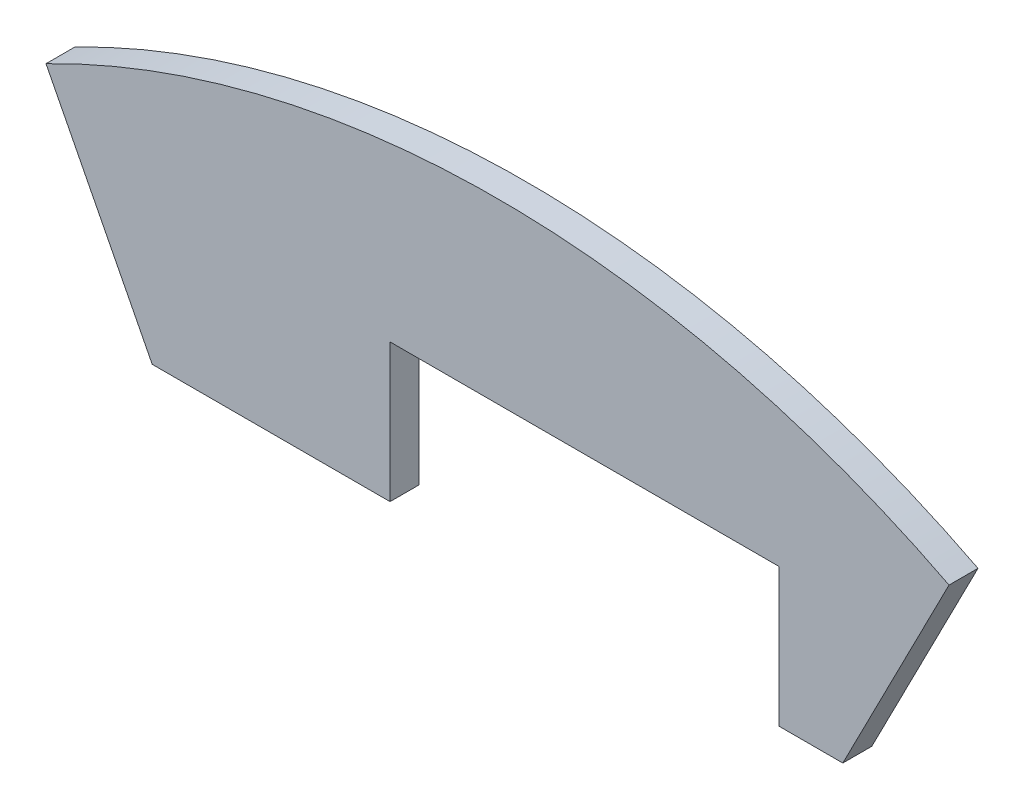
ISO-10303-21;
HEADER;
FILE_DESCRIPTION(('STEP AP214'),'2;1');
FILE_NAME('part.step','',(''),(''),'','','');
FILE_SCHEMA(('AUTOMOTIVE_DESIGN { 1 0 10303 214 1 1 1 1 }'));
ENDSEC;
DATA;
#1=APPLICATION_CONTEXT('core data for automotive mechanical design processes');
#2=APPLICATION_PROTOCOL_DEFINITION('international standard','automotive_design',2000,#1);
#3=PRODUCT_CONTEXT('',#1,'mechanical');
#4=PRODUCT('Part','Part','',(#3));
#5=PRODUCT_RELATED_PRODUCT_CATEGORY('part','',(#4));
#6=PRODUCT_DEFINITION_FORMATION('','',#4);
#7=PRODUCT_DEFINITION_CONTEXT('part definition',#1,'design');
#8=PRODUCT_DEFINITION('design','',#6,#7);
#9=PRODUCT_DEFINITION_SHAPE('','',#8);
#10=(LENGTH_UNIT() NAMED_UNIT(*) SI_UNIT(.MILLI.,.METRE.));
#11=(NAMED_UNIT(*) PLANE_ANGLE_UNIT() SI_UNIT($,.RADIAN.));
#12=(NAMED_UNIT(*) SI_UNIT($,.STERADIAN.) SOLID_ANGLE_UNIT());
#13=UNCERTAINTY_MEASURE_WITH_UNIT(LENGTH_MEASURE(1.E-05),#10,'distance_accuracy_value','');
#14=(GEOMETRIC_REPRESENTATION_CONTEXT(3) GLOBAL_UNCERTAINTY_ASSIGNED_CONTEXT((#13)) GLOBAL_UNIT_ASSIGNED_CONTEXT((#10,
#11,#12)) REPRESENTATION_CONTEXT('',''));
#15=CARTESIAN_POINT('',(0.,0.,0.));
#16=DIRECTION('',(0.,0.,1.));
#17=DIRECTION('',(1.,0.,0.));
#18=AXIS2_PLACEMENT_3D('',#15,#16,#17);
#19=CARTESIAN_POINT('',(-11.78,73.8595635754552,3.175));
#20=DIRECTION('',(-1.,0.,0.));
#21=DIRECTION('',(0.,0.,1.));
#22=AXIS2_PLACEMENT_3D('',#19,#20,#21);
#23=PLANE('',#22);
#24=DIRECTION('',(0.,1.,0.));
#25=VECTOR('',#24,1.);
#26=CARTESIAN_POINT('',(-11.78,73.8595635754552,0.));
#27=LINE('',#26,#25);
#28=CARTESIAN_POINT('',(-11.78,73.8595635754552,0.));
#29=VERTEX_POINT('',#28);
#30=CARTESIAN_POINT('',(-11.78,89.0244871513204,0.));
#31=VERTEX_POINT('',#30);
#32=EDGE_CURVE('E127',#29,#31,#27,.T.);
#33=ORIENTED_EDGE('',*,*,#32,.T.);
#34=DIRECTION('',(0.,0.,-1.));
#35=VECTOR('',#34,1.);
#36=CARTESIAN_POINT('',(-11.78,89.0244871513204,3.175));
#37=LINE('',#36,#35);
#38=CARTESIAN_POINT('',(-11.78,89.0244871513204,3.175));
#39=VERTEX_POINT('',#38);
#40=EDGE_CURVE('E11',#39,#31,#37,.T.);
#41=ORIENTED_EDGE('',*,*,#40,.F.);
#42=DIRECTION('',(0.,1.,0.));
#43=VECTOR('',#42,1.);
#44=CARTESIAN_POINT('',(-11.78,73.8595635754552,3.175));
#45=LINE('',#44,#43);
#46=CARTESIAN_POINT('',(-11.78,73.8595635754552,3.175));
#47=VERTEX_POINT('',#46);
#48=EDGE_CURVE('E141',#47,#39,#45,.T.);
#49=ORIENTED_EDGE('',*,*,#48,.F.);
#50=DIRECTION('',(0.,0.,-1.));
#51=VECTOR('',#50,1.);
#52=CARTESIAN_POINT('',(-11.78,73.8595635754552,3.175));
#53=LINE('',#52,#51);
#54=EDGE_CURVE('E123',#47,#29,#53,.T.);
#55=ORIENTED_EDGE('',*,*,#54,.T.);
#56=EDGE_LOOP('',(#33,#41,#49,#55));
#57=FACE_BOUND('',#56,.T.);
#58=ADVANCED_FACE('F31',(#57),#23,.F.);
#59=CARTESIAN_POINT('',(-11.78,89.0244871513204,3.175));
#60=DIRECTION('',(0.,1.,0.));
#61=DIRECTION('',(0.,0.,1.));
#62=AXIS2_PLACEMENT_3D('',#59,#60,#61);
#63=PLANE('',#62);
#64=DIRECTION('',(1.,0.,0.));
#65=VECTOR('',#64,1.);
#66=CARTESIAN_POINT('',(-11.78,89.0244871513204,0.));
#67=LINE('',#66,#65);
#68=CARTESIAN_POINT('',(30.85,89.0244871513204,0.));
#69=VERTEX_POINT('',#68);
#70=EDGE_CURVE('E130',#31,#69,#67,.T.);
#71=ORIENTED_EDGE('',*,*,#70,.T.);
#72=DIRECTION('',(0.,0.,-1.));
#73=VECTOR('',#72,1.);
#74=CARTESIAN_POINT('',(30.85,89.0244871513204,3.175));
#75=LINE('',#74,#73);
#76=CARTESIAN_POINT('',(30.85,89.0244871513204,3.175));
#77=VERTEX_POINT('',#76);
#78=EDGE_CURVE('E39',#77,#69,#75,.T.);
#79=ORIENTED_EDGE('',*,*,#78,.F.);
#80=DIRECTION('',(1.,0.,0.));
#81=VECTOR('',#80,1.);
#82=CARTESIAN_POINT('',(-11.78,89.0244871513204,3.175));
#83=LINE('',#82,#81);
#84=EDGE_CURVE('E90',#39,#77,#83,.T.);
#85=ORIENTED_EDGE('',*,*,#84,.F.);
#86=ORIENTED_EDGE('',*,*,#40,.T.);
#87=EDGE_LOOP('',(#71,#79,#85,#86));
#88=FACE_BOUND('',#87,.T.);
#89=ADVANCED_FACE('F176',(#88),#63,.F.);
#90=CARTESIAN_POINT('',(30.85,89.0244871513204,3.175));
#91=DIRECTION('',(1.,0.,0.));
#92=DIRECTION('',(0.,1.,0.));
#93=AXIS2_PLACEMENT_3D('',#90,#91,#92);
#94=PLANE('',#93);
#95=DIRECTION('',(0.,-1.,0.));
#96=VECTOR('',#95,1.);
#97=CARTESIAN_POINT('',(30.85,89.0244871513204,0.));
#98=LINE('',#97,#96);
#99=CARTESIAN_POINT('',(30.85,73.8595635754553,0.));
#100=VERTEX_POINT('',#99);
#101=EDGE_CURVE('E132',#69,#100,#98,.T.);
#102=ORIENTED_EDGE('',*,*,#101,.T.);
#103=DIRECTION('',(0.,0.,-1.));
#104=VECTOR('',#103,1.);
#105=CARTESIAN_POINT('',(30.85,73.8595635754553,3.175));
#106=LINE('',#105,#104);
#107=CARTESIAN_POINT('',(30.85,73.8595635754553,3.175));
#108=VERTEX_POINT('',#107);
#109=EDGE_CURVE('E148',#108,#100,#106,.T.);
#110=ORIENTED_EDGE('',*,*,#109,.F.);
#111=DIRECTION('',(0.,-1.,0.));
#112=VECTOR('',#111,1.);
#113=CARTESIAN_POINT('',(30.85,89.0244871513204,3.175));
#114=LINE('',#113,#112);
#115=EDGE_CURVE('E156',#77,#108,#114,.T.);
#116=ORIENTED_EDGE('',*,*,#115,.F.);
#117=ORIENTED_EDGE('',*,*,#78,.T.);
#118=EDGE_LOOP('',(#102,#110,#116,#117));
#119=FACE_BOUND('',#118,.T.);
#120=ADVANCED_FACE('F154',(#119),#94,.F.);
#121=CARTESIAN_POINT('',(30.85,73.8595635754553,3.175));
#122=DIRECTION('',(0.,1.,0.));
#123=DIRECTION('',(-1.,0.,0.));
#124=AXIS2_PLACEMENT_3D('',#121,#122,#123);
#125=PLANE('',#124);
#126=DIRECTION('',(1.,0.,0.));
#127=VECTOR('',#126,1.);
#128=CARTESIAN_POINT('',(30.85,73.8595635754553,0.));
#129=LINE('',#128,#127);
#130=CARTESIAN_POINT('',(37.85,73.8595635754552,0.));
#131=VERTEX_POINT('',#130);
#132=EDGE_CURVE('E134',#100,#131,#129,.T.);
#133=ORIENTED_EDGE('',*,*,#132,.T.);
#134=DIRECTION('',(0.,0.,-1.));
#135=VECTOR('',#134,1.);
#136=CARTESIAN_POINT('',(37.85,73.8595635754552,3.175));
#137=LINE('',#136,#135);
#138=CARTESIAN_POINT('',(37.85,73.8595635754552,3.175));
#139=VERTEX_POINT('',#138);
#140=EDGE_CURVE('E145',#139,#131,#137,.T.);
#141=ORIENTED_EDGE('',*,*,#140,.F.);
#142=DIRECTION('',(1.,0.,0.));
#143=VECTOR('',#142,1.);
#144=CARTESIAN_POINT('',(30.85,73.8595635754553,3.175));
#145=LINE('',#144,#143);
#146=EDGE_CURVE('E168',#108,#139,#145,.T.);
#147=ORIENTED_EDGE('',*,*,#146,.F.);
#148=ORIENTED_EDGE('',*,*,#109,.T.);
#149=EDGE_LOOP('',(#133,#141,#147,#148));
#150=FACE_BOUND('',#149,.T.);
#151=ADVANCED_FACE('F164',(#150),#125,.F.);
#152=CARTESIAN_POINT('',(37.85,73.8595635754552,3.175));
#153=DIRECTION('',(-0.889948050823409,0.456061911187084,0.));
#154=DIRECTION('',(-0.456061911187084,-0.889948050823409,0.));
#155=AXIS2_PLACEMENT_3D('',#152,#153,#154);
#156=PLANE('',#155);
#157=DIRECTION('',(0.456061911187084,0.889948050823409,0.));
#158=VECTOR('',#157,1.);
#159=CARTESIAN_POINT('',(37.85,73.8595635754552,0.));
#160=LINE('',#159,#158);
#161=CARTESIAN_POINT('',(49.4932605926063,96.5799373129768,0.));
#162=VERTEX_POINT('',#161);
#163=EDGE_CURVE('E136',#131,#162,#160,.T.);
#164=ORIENTED_EDGE('',*,*,#163,.T.);
#165=DIRECTION('',(0.,0.,-1.));
#166=VECTOR('',#165,1.);
#167=CARTESIAN_POINT('',(49.4932605926063,96.5799373129768,3.175));
#168=LINE('',#167,#166);
#169=CARTESIAN_POINT('',(49.4932605926063,96.5799373129768,3.175));
#170=VERTEX_POINT('',#169);
#171=EDGE_CURVE('E118',#170,#162,#168,.T.);
#172=ORIENTED_EDGE('',*,*,#171,.F.);
#173=DIRECTION('',(0.456061911187084,0.889948050823409,0.));
#174=VECTOR('',#173,1.);
#175=CARTESIAN_POINT('',(37.85,73.8595635754552,3.175));
#176=LINE('',#175,#174);
#177=EDGE_CURVE('E109',#139,#170,#176,.T.);
#178=ORIENTED_EDGE('',*,*,#177,.F.);
#179=ORIENTED_EDGE('',*,*,#140,.T.);
#180=EDGE_LOOP('',(#164,#172,#178,#179));
#181=FACE_BOUND('',#180,.T.);
#182=ADVANCED_FACE('F167',(#181),#156,.F.);
#183=CARTESIAN_POINT('',(0.,0.,3.175));
#184=DIRECTION('',(0.,0.,-1.));
#185=DIRECTION('',(-1.,0.,0.));
#186=AXIS2_PLACEMENT_3D('',#183,#184,#185);
#187=CYLINDRICAL_SURFACE('',#186,108.523117977075);
#188=CARTESIAN_POINT('',(0.,0.,0.));
#189=DIRECTION('',(0.,0.,1.));
#190=DIRECTION('',(1.,0.,0.));
#191=AXIS2_PLACEMENT_3D('',#188,#189,#190);
#192=CIRCLE('',#191,108.523117977075);
#193=CARTESIAN_POINT('',(-49.4932605926063,96.5799373129768,0.));
#194=VERTEX_POINT('',#193);
#195=EDGE_CURVE('E117',#162,#194,#192,.T.);
#196=ORIENTED_EDGE('',*,*,#195,.T.);
#197=DIRECTION('',(0.,0.,-1.));
#198=VECTOR('',#197,1.);
#199=CARTESIAN_POINT('',(-49.4932605926063,96.5799373129768,3.175));
#200=LINE('',#199,#198);
#201=CARTESIAN_POINT('',(-49.4932605926063,96.5799373129768,3.175));
#202=VERTEX_POINT('',#201);
#203=EDGE_CURVE('E114',#202,#194,#200,.T.);
#204=ORIENTED_EDGE('',*,*,#203,.F.);
#205=CARTESIAN_POINT('',(0.,0.,3.175));
#206=DIRECTION('',(0.,0.,1.));
#207=DIRECTION('',(1.,0.,0.));
#208=AXIS2_PLACEMENT_3D('',#205,#206,#207);
#209=CIRCLE('',#208,108.523117977075);
#210=EDGE_CURVE('E103',#170,#202,#209,.T.);
#211=ORIENTED_EDGE('',*,*,#210,.F.);
#212=ORIENTED_EDGE('',*,*,#171,.T.);
#213=EDGE_LOOP('',(#196,#204,#211,#212));
#214=FACE_BOUND('',#213,.T.);
#215=ADVANCED_FACE('F115',(#214),#187,.T.);
#216=CARTESIAN_POINT('',(-49.4932605926063,96.5799373129768,3.175));
#217=DIRECTION('',(0.889948050823409,0.456061911187084,0.));
#218=DIRECTION('',(-0.456061911187084,0.889948050823409,0.));
#219=AXIS2_PLACEMENT_3D('',#216,#217,#218);
#220=PLANE('',#219);
#221=DIRECTION('',(0.456061911187084,-0.889948050823409,0.));
#222=VECTOR('',#221,1.);
#223=CARTESIAN_POINT('',(-49.4932605926063,96.5799373129768,0.));
#224=LINE('',#223,#222);
#225=CARTESIAN_POINT('',(-37.85,73.8595635754552,0.));
#226=VERTEX_POINT('',#225);
#227=EDGE_CURVE('E76',#194,#226,#224,.T.);
#228=ORIENTED_EDGE('',*,*,#227,.T.);
#229=DIRECTION('',(0.,0.,-1.));
#230=VECTOR('',#229,1.);
#231=CARTESIAN_POINT('',(-37.85,73.8595635754552,3.175));
#232=LINE('',#231,#230);
#233=CARTESIAN_POINT('',(-37.85,73.8595635754552,3.175));
#234=VERTEX_POINT('',#233);
#235=EDGE_CURVE('E119',#234,#226,#232,.T.);
#236=ORIENTED_EDGE('',*,*,#235,.F.);
#237=DIRECTION('',(0.456061911187084,-0.889948050823409,0.));
#238=VECTOR('',#237,1.);
#239=CARTESIAN_POINT('',(-49.4932605926063,96.5799373129768,3.175));
#240=LINE('',#239,#238);
#241=EDGE_CURVE('E107',#202,#234,#240,.T.);
#242=ORIENTED_EDGE('',*,*,#241,.F.);
#243=ORIENTED_EDGE('',*,*,#203,.T.);
#244=EDGE_LOOP('',(#228,#236,#242,#243));
#245=FACE_BOUND('',#244,.T.);
#246=ADVANCED_FACE('F121',(#245),#220,.F.);
#247=CARTESIAN_POINT('',(-37.85,73.8595635754552,3.175));
#248=DIRECTION('',(0.,1.,0.));
#249=DIRECTION('',(-1.,0.,0.));
#250=AXIS2_PLACEMENT_3D('',#247,#248,#249);
#251=PLANE('',#250);
#252=DIRECTION('',(1.,0.,0.));
#253=VECTOR('',#252,1.);
#254=CARTESIAN_POINT('',(-37.85,73.8595635754552,0.));
#255=LINE('',#254,#253);
#256=EDGE_CURVE('E82',#226,#29,#255,.T.);
#257=ORIENTED_EDGE('',*,*,#256,.T.);
#258=ORIENTED_EDGE('',*,*,#54,.F.);
#259=DIRECTION('',(1.,0.,0.));
#260=VECTOR('',#259,1.);
#261=CARTESIAN_POINT('',(-37.85,73.8595635754552,3.175));
#262=LINE('',#261,#260);
#263=EDGE_CURVE('E47',#234,#47,#262,.T.);
#264=ORIENTED_EDGE('',*,*,#263,.F.);
#265=ORIENTED_EDGE('',*,*,#235,.T.);
#266=EDGE_LOOP('',(#257,#258,#264,#265));
#267=FACE_BOUND('',#266,.T.);
#268=ADVANCED_FACE('F192',(#267),#251,.F.);
#269=CARTESIAN_POINT('',(0.,0.,3.175));
#270=DIRECTION('',(0.,0.,1.));
#271=DIRECTION('',(1.,0.,0.));
#272=AXIS2_PLACEMENT_3D('',#269,#270,#271);
#273=PLANE('',#272);
#274=ORIENTED_EDGE('',*,*,#48,.T.);
#275=ORIENTED_EDGE('',*,*,#84,.T.);
#276=ORIENTED_EDGE('',*,*,#115,.T.);
#277=ORIENTED_EDGE('',*,*,#146,.T.);
#278=ORIENTED_EDGE('',*,*,#177,.T.);
#279=ORIENTED_EDGE('',*,*,#210,.T.);
#280=ORIENTED_EDGE('',*,*,#241,.T.);
#281=ORIENTED_EDGE('',*,*,#263,.T.);
#282=EDGE_LOOP('',(#274,#275,#276,#277,#278,#279,#280,#281));
#283=FACE_BOUND('',#282,.T.);
#284=ADVANCED_FACE('F105',(#283),#273,.T.);
#285=CARTESIAN_POINT('',(0.,0.,0.));
#286=DIRECTION('',(0.,0.,1.));
#287=DIRECTION('',(1.,0.,0.));
#288=AXIS2_PLACEMENT_3D('',#285,#286,#287);
#289=PLANE('',#288);
#290=ORIENTED_EDGE('',*,*,#32,.F.);
#291=ORIENTED_EDGE('',*,*,#256,.F.);
#292=ORIENTED_EDGE('',*,*,#227,.F.);
#293=ORIENTED_EDGE('',*,*,#195,.F.);
#294=ORIENTED_EDGE('',*,*,#163,.F.);
#295=ORIENTED_EDGE('',*,*,#132,.F.);
#296=ORIENTED_EDGE('',*,*,#101,.F.);
#297=ORIENTED_EDGE('',*,*,#70,.F.);
#298=EDGE_LOOP('',(#290,#291,#292,#293,#294,#295,#296,#297));
#299=FACE_BOUND('',#298,.T.);
#300=ADVANCED_FACE('F160',(#299),#289,.F.);
#301=CLOSED_SHELL('',(#58,#89,#120,#151,#182,#215,#246,#268,#284,#300));
#302=MANIFOLD_SOLID_BREP('B2',#301);
#303=ADVANCED_BREP_SHAPE_REPRESENTATION('',(#18,#302),#14);
#304=SHAPE_DEFINITION_REPRESENTATION(#9,#303);
ENDSEC;
END-ISO-10303-21;
